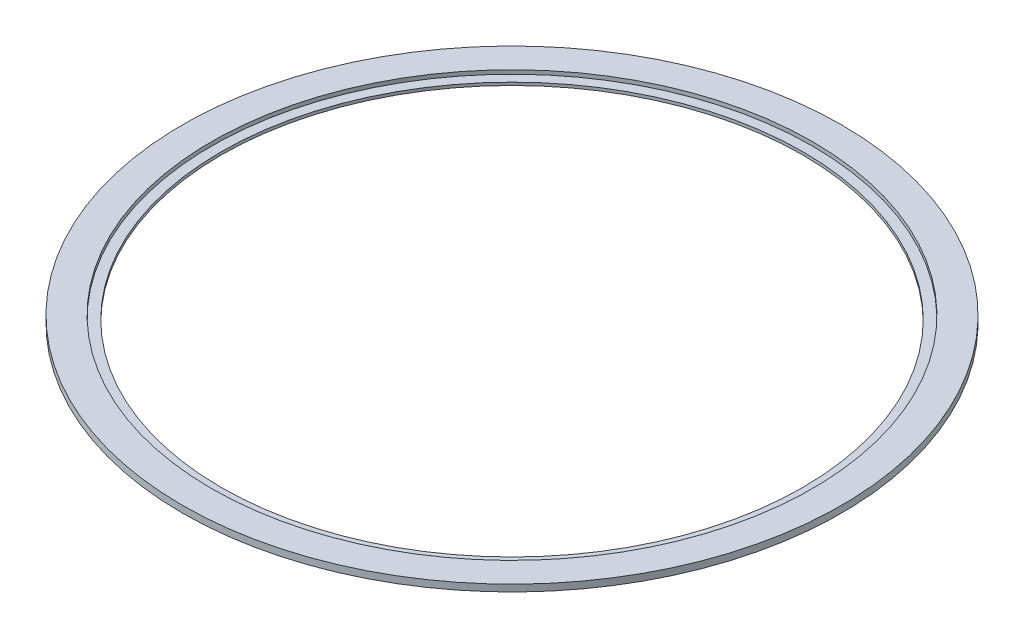
ISO-10303-21;
HEADER;
FILE_DESCRIPTION(('STEP AP214'),'2;1');
FILE_NAME('part.step','',(''),(''),'','','');
FILE_SCHEMA(('AUTOMOTIVE_DESIGN { 1 0 10303 214 1 1 1 1 }'));
ENDSEC;
DATA;
#1=APPLICATION_CONTEXT('core data for automotive mechanical design processes');
#2=APPLICATION_PROTOCOL_DEFINITION('international standard','automotive_design',2000,#1);
#3=PRODUCT_CONTEXT('',#1,'mechanical');
#4=PRODUCT('Part','Part','',(#3));
#5=PRODUCT_RELATED_PRODUCT_CATEGORY('part','',(#4));
#6=PRODUCT_DEFINITION_FORMATION('','',#4);
#7=PRODUCT_DEFINITION_CONTEXT('part definition',#1,'design');
#8=PRODUCT_DEFINITION('design','',#6,#7);
#9=PRODUCT_DEFINITION_SHAPE('','',#8);
#10=(LENGTH_UNIT() NAMED_UNIT(*) SI_UNIT(.MILLI.,.METRE.));
#11=(NAMED_UNIT(*) PLANE_ANGLE_UNIT() SI_UNIT($,.RADIAN.));
#12=(NAMED_UNIT(*) SI_UNIT($,.STERADIAN.) SOLID_ANGLE_UNIT());
#13=UNCERTAINTY_MEASURE_WITH_UNIT(LENGTH_MEASURE(1.E-05),#10,'distance_accuracy_value','');
#14=(GEOMETRIC_REPRESENTATION_CONTEXT(3) GLOBAL_UNCERTAINTY_ASSIGNED_CONTEXT((#13)) GLOBAL_UNIT_ASSIGNED_CONTEXT((#10,
#11,#12)) REPRESENTATION_CONTEXT('',''));
#15=CARTESIAN_POINT('',(0.,0.,0.));
#16=DIRECTION('',(0.,0.,1.));
#17=DIRECTION('',(1.,0.,0.));
#18=AXIS2_PLACEMENT_3D('',#15,#16,#17);
#19=CARTESIAN_POINT('',(0.,1.5,0.));
#20=DIRECTION('',(0.,1.,0.));
#21=DIRECTION('',(0.,0.,1.));
#22=AXIS2_PLACEMENT_3D('',#19,#20,#21);
#23=PLANE('',#22);
#24=CARTESIAN_POINT('',(0.,1.5,0.));
#25=DIRECTION('',(0.,1.,0.));
#26=DIRECTION('',(0.,0.,1.));
#27=AXIS2_PLACEMENT_3D('',#24,#25,#26);
#28=CIRCLE('',#27,150.);
#29=CARTESIAN_POINT('',(0.,1.5,150.));
#30=VERTEX_POINT('',#29);
#31=EDGE_CURVE('E10',#30,#30,#28,.T.);
#32=ORIENTED_EDGE('',*,*,#31,.F.);
#33=EDGE_LOOP('',(#32));
#34=FACE_BOUND('',#33,.T.);
#35=CARTESIAN_POINT('',(0.,1.5,0.));
#36=DIRECTION('',(0.,1.,0.));
#37=DIRECTION('',(0.,0.,1.));
#38=AXIS2_PLACEMENT_3D('',#35,#36,#37);
#39=CIRCLE('',#38,155.);
#40=CARTESIAN_POINT('',(0.,1.5,155.));
#41=VERTEX_POINT('',#40);
#42=EDGE_CURVE('E47',#41,#41,#39,.T.);
#43=ORIENTED_EDGE('',*,*,#42,.T.);
#44=EDGE_LOOP('',(#43));
#45=FACE_BOUND('',#44,.T.);
#46=ADVANCED_FACE('F31',(#34,#45),#23,.T.);
#47=CARTESIAN_POINT('',(0.,0.,0.));
#48=DIRECTION('',(0.,1.,0.));
#49=DIRECTION('',(0.,0.,1.));
#50=AXIS2_PLACEMENT_3D('',#47,#48,#49);
#51=PLANE('',#50);
#52=CARTESIAN_POINT('',(0.,0.,0.));
#53=DIRECTION('',(0.,1.,0.));
#54=DIRECTION('',(0.,0.,1.));
#55=AXIS2_PLACEMENT_3D('',#52,#53,#54);
#56=CIRCLE('',#55,150.);
#57=CARTESIAN_POINT('',(0.,0.,150.));
#58=VERTEX_POINT('',#57);
#59=EDGE_CURVE('E35',#58,#58,#56,.T.);
#60=ORIENTED_EDGE('',*,*,#59,.T.);
#61=EDGE_LOOP('',(#60));
#62=FACE_BOUND('',#61,.T.);
#63=CARTESIAN_POINT('',(0.,0.,0.));
#64=DIRECTION('',(0.,1.,0.));
#65=DIRECTION('',(0.,0.,1.));
#66=AXIS2_PLACEMENT_3D('',#63,#64,#65);
#67=CIRCLE('',#66,170.);
#68=CARTESIAN_POINT('',(0.,0.,170.));
#69=VERTEX_POINT('',#68);
#70=EDGE_CURVE('E42',#69,#69,#67,.F.);
#71=ORIENTED_EDGE('',*,*,#70,.T.);
#72=EDGE_LOOP('',(#71));
#73=FACE_BOUND('',#72,.T.);
#74=ADVANCED_FACE('F33',(#62,#73),#51,.F.);
#75=CARTESIAN_POINT('',(0.,1.5,0.));
#76=DIRECTION('',(0.,-1.,0.));
#77=DIRECTION('',(0.,0.,-1.));
#78=AXIS2_PLACEMENT_3D('',#75,#76,#77);
#79=CYLINDRICAL_SURFACE('',#78,150.);
#80=ORIENTED_EDGE('',*,*,#31,.T.);
#81=EDGE_LOOP('',(#80));
#82=FACE_BOUND('',#81,.T.);
#83=ORIENTED_EDGE('',*,*,#59,.F.);
#84=EDGE_LOOP('',(#83));
#85=FACE_BOUND('',#84,.T.);
#86=ADVANCED_FACE('F67',(#82,#85),#79,.F.);
#87=CARTESIAN_POINT('',(0.,3.5,0.));
#88=DIRECTION('',(0.,1.,0.));
#89=DIRECTION('',(0.,0.,1.));
#90=AXIS2_PLACEMENT_3D('',#87,#88,#89);
#91=PLANE('',#90);
#92=CARTESIAN_POINT('',(0.,3.5,0.));
#93=DIRECTION('',(0.,1.,0.));
#94=DIRECTION('',(0.,0.,1.));
#95=AXIS2_PLACEMENT_3D('',#92,#93,#94);
#96=CIRCLE('',#95,155.);
#97=CARTESIAN_POINT('',(0.,3.5,155.));
#98=VERTEX_POINT('',#97);
#99=EDGE_CURVE('E50',#98,#98,#96,.T.);
#100=ORIENTED_EDGE('',*,*,#99,.F.);
#101=EDGE_LOOP('',(#100));
#102=FACE_BOUND('',#101,.T.);
#103=CARTESIAN_POINT('',(0.,3.5,0.));
#104=DIRECTION('',(0.,1.,0.));
#105=DIRECTION('',(0.,0.,1.));
#106=AXIS2_PLACEMENT_3D('',#103,#104,#105);
#107=CIRCLE('',#106,170.);
#108=CARTESIAN_POINT('',(0.,3.5,170.));
#109=VERTEX_POINT('',#108);
#110=EDGE_CURVE('E44',#109,#109,#107,.T.);
#111=ORIENTED_EDGE('',*,*,#110,.T.);
#112=EDGE_LOOP('',(#111));
#113=FACE_BOUND('',#112,.T.);
#114=ADVANCED_FACE('F64',(#102,#113),#91,.T.);
#115=CARTESIAN_POINT('',(0.,-480.832611206852,0.));
#116=DIRECTION('',(0.,1.,0.));
#117=DIRECTION('',(0.,0.,1.));
#118=AXIS2_PLACEMENT_3D('',#115,#116,#117);
#119=CYLINDRICAL_SURFACE('',#118,170.);
#120=ORIENTED_EDGE('',*,*,#70,.F.);
#121=EDGE_LOOP('',(#120));
#122=FACE_BOUND('',#121,.T.);
#123=ORIENTED_EDGE('',*,*,#110,.F.);
#124=EDGE_LOOP('',(#123));
#125=FACE_BOUND('',#124,.T.);
#126=ADVANCED_FACE('F60',(#122,#125),#119,.T.);
#127=CARTESIAN_POINT('',(0.,1.5,0.));
#128=DIRECTION('',(0.,1.,0.));
#129=DIRECTION('',(0.,0.,1.));
#130=AXIS2_PLACEMENT_3D('',#127,#128,#129);
#131=CYLINDRICAL_SURFACE('',#130,155.);
#132=ORIENTED_EDGE('',*,*,#42,.F.);
#133=EDGE_LOOP('',(#132));
#134=FACE_BOUND('',#133,.T.);
#135=ORIENTED_EDGE('',*,*,#99,.T.);
#136=EDGE_LOOP('',(#135));
#137=FACE_BOUND('',#136,.T.);
#138=ADVANCED_FACE('F57',(#134,#137),#131,.F.);
#139=CLOSED_SHELL('',(#46,#74,#86,#114,#126,#138));
#140=MANIFOLD_SOLID_BREP('B2',#139);
#141=ADVANCED_BREP_SHAPE_REPRESENTATION('',(#18,#140),#14);
#142=SHAPE_DEFINITION_REPRESENTATION(#9,#141);
ENDSEC;
END-ISO-10303-21;
